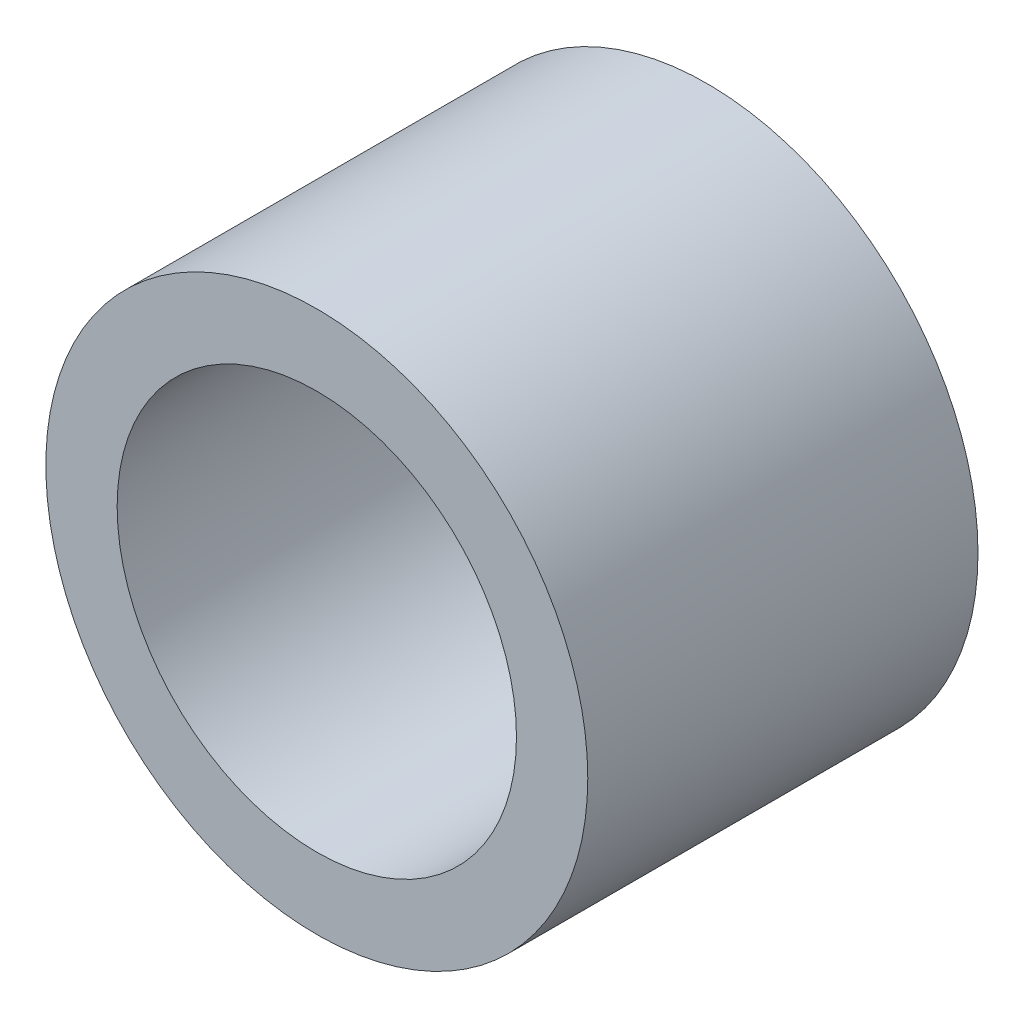
ISO-10303-21;
HEADER;
FILE_DESCRIPTION(('STEP AP214'),'2;1');
FILE_NAME('part.step','',(''),(''),'','','');
FILE_SCHEMA(('AUTOMOTIVE_DESIGN { 1 0 10303 214 1 1 1 1 }'));
ENDSEC;
DATA;
#1=APPLICATION_CONTEXT('core data for automotive mechanical design processes');
#2=APPLICATION_PROTOCOL_DEFINITION('international standard','automotive_design',2000,#1);
#3=PRODUCT_CONTEXT('',#1,'mechanical');
#4=PRODUCT('Part','Part','',(#3));
#5=PRODUCT_RELATED_PRODUCT_CATEGORY('part','',(#4));
#6=PRODUCT_DEFINITION_FORMATION('','',#4);
#7=PRODUCT_DEFINITION_CONTEXT('part definition',#1,'design');
#8=PRODUCT_DEFINITION('design','',#6,#7);
#9=PRODUCT_DEFINITION_SHAPE('','',#8);
#10=(LENGTH_UNIT() NAMED_UNIT(*) SI_UNIT(.MILLI.,.METRE.));
#11=(NAMED_UNIT(*) PLANE_ANGLE_UNIT() SI_UNIT($,.RADIAN.));
#12=(NAMED_UNIT(*) SI_UNIT($,.STERADIAN.) SOLID_ANGLE_UNIT());
#13=UNCERTAINTY_MEASURE_WITH_UNIT(LENGTH_MEASURE(1.E-05),#10,'distance_accuracy_value','');
#14=(GEOMETRIC_REPRESENTATION_CONTEXT(3) GLOBAL_UNCERTAINTY_ASSIGNED_CONTEXT((#13)) GLOBAL_UNIT_ASSIGNED_CONTEXT((#10,
#11,#12)) REPRESENTATION_CONTEXT('',''));
#15=CARTESIAN_POINT('',(0.,0.,0.));
#16=DIRECTION('',(0.,0.,1.));
#17=DIRECTION('',(1.,0.,0.));
#18=AXIS2_PLACEMENT_3D('',#15,#16,#17);
#19=CARTESIAN_POINT('',(0.,0.,6.94944));
#20=DIRECTION('',(0.,0.,1.));
#21=DIRECTION('',(1.,0.,0.));
#22=AXIS2_PLACEMENT_3D('',#19,#20,#21);
#23=PLANE('',#22);
#24=CARTESIAN_POINT('',(0.,0.,6.94944));
#25=DIRECTION('',(0.,0.,1.));
#26=DIRECTION('',(1.,0.,0.));
#27=AXIS2_PLACEMENT_3D('',#24,#25,#26);
#28=CIRCLE('',#27,4.826);
#29=CARTESIAN_POINT('',(4.826,0.,6.94944));
#30=VERTEX_POINT('',#29);
#31=EDGE_CURVE('E10',#30,#30,#28,.T.);
#32=ORIENTED_EDGE('',*,*,#31,.T.);
#33=EDGE_LOOP('',(#32));
#34=FACE_BOUND('',#33,.T.);
#35=CARTESIAN_POINT('',(0.,0.,6.94944));
#36=DIRECTION('',(0.,0.,1.));
#37=DIRECTION('',(1.,0.,0.));
#38=AXIS2_PLACEMENT_3D('',#35,#36,#37);
#39=CIRCLE('',#38,3.556);
#40=CARTESIAN_POINT('',(3.556,0.,6.94944));
#41=VERTEX_POINT('',#40);
#42=EDGE_CURVE('E42',#41,#41,#39,.T.);
#43=ORIENTED_EDGE('',*,*,#42,.F.);
#44=EDGE_LOOP('',(#43));
#45=FACE_BOUND('',#44,.T.);
#46=ADVANCED_FACE('F31',(#34,#45),#23,.T.);
#47=CARTESIAN_POINT('',(0.,0.,0.));
#48=DIRECTION('',(0.,0.,1.));
#49=DIRECTION('',(1.,0.,0.));
#50=AXIS2_PLACEMENT_3D('',#47,#48,#49);
#51=PLANE('',#50);
#52=CARTESIAN_POINT('',(0.,0.,0.));
#53=DIRECTION('',(0.,0.,1.));
#54=DIRECTION('',(1.,0.,0.));
#55=AXIS2_PLACEMENT_3D('',#52,#53,#54);
#56=CIRCLE('',#55,4.826);
#57=CARTESIAN_POINT('',(4.826,0.,0.));
#58=VERTEX_POINT('',#57);
#59=EDGE_CURVE('E35',#58,#58,#56,.T.);
#60=ORIENTED_EDGE('',*,*,#59,.F.);
#61=EDGE_LOOP('',(#60));
#62=FACE_BOUND('',#61,.T.);
#63=CARTESIAN_POINT('',(0.,0.,0.));
#64=DIRECTION('',(0.,0.,1.));
#65=DIRECTION('',(1.,0.,0.));
#66=AXIS2_PLACEMENT_3D('',#63,#64,#65);
#67=CIRCLE('',#66,3.556);
#68=CARTESIAN_POINT('',(3.556,0.,0.));
#69=VERTEX_POINT('',#68);
#70=EDGE_CURVE('E44',#69,#69,#67,.T.);
#71=ORIENTED_EDGE('',*,*,#70,.T.);
#72=EDGE_LOOP('',(#71));
#73=FACE_BOUND('',#72,.T.);
#74=ADVANCED_FACE('F54',(#62,#73),#51,.F.);
#75=CARTESIAN_POINT('',(0.,0.,6.94944));
#76=DIRECTION('',(0.,0.,-1.));
#77=DIRECTION('',(-1.,0.,0.));
#78=AXIS2_PLACEMENT_3D('',#75,#76,#77);
#79=CYLINDRICAL_SURFACE('',#78,4.826);
#80=ORIENTED_EDGE('',*,*,#31,.F.);
#81=EDGE_LOOP('',(#80));
#82=FACE_BOUND('',#81,.T.);
#83=ORIENTED_EDGE('',*,*,#59,.T.);
#84=EDGE_LOOP('',(#83));
#85=FACE_BOUND('',#84,.T.);
#86=ADVANCED_FACE('F33',(#82,#85),#79,.T.);
#87=CARTESIAN_POINT('',(0.,0.,6.94944));
#88=DIRECTION('',(0.,0.,-1.));
#89=DIRECTION('',(-1.,0.,0.));
#90=AXIS2_PLACEMENT_3D('',#87,#88,#89);
#91=CYLINDRICAL_SURFACE('',#90,3.556);
#92=ORIENTED_EDGE('',*,*,#42,.T.);
#93=EDGE_LOOP('',(#92));
#94=FACE_BOUND('',#93,.T.);
#95=ORIENTED_EDGE('',*,*,#70,.F.);
#96=EDGE_LOOP('',(#95));
#97=FACE_BOUND('',#96,.T.);
#98=ADVANCED_FACE('F50',(#94,#97),#91,.F.);
#99=CLOSED_SHELL('',(#46,#74,#86,#98));
#100=MANIFOLD_SOLID_BREP('B2',#99);
#101=ADVANCED_BREP_SHAPE_REPRESENTATION('',(#18,#100),#14);
#102=SHAPE_DEFINITION_REPRESENTATION(#9,#101);
ENDSEC;
END-ISO-10303-21;
